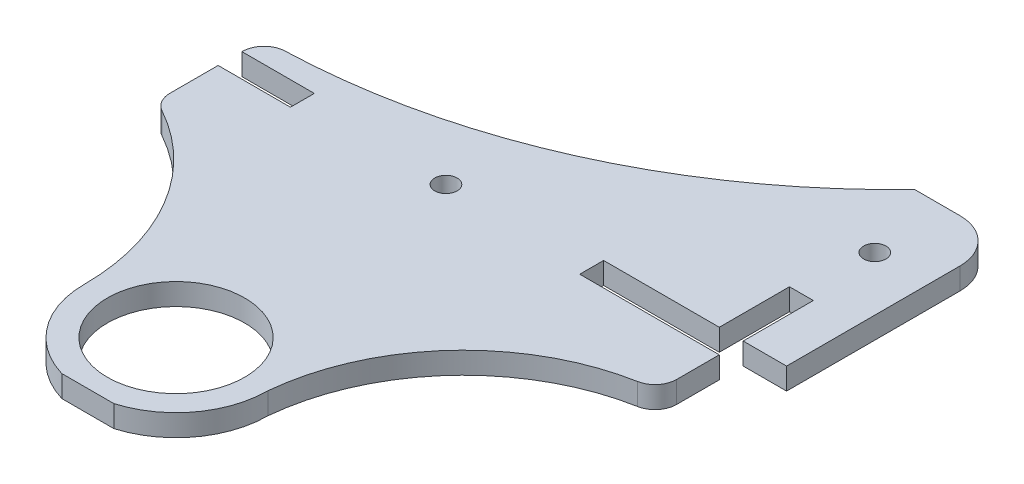
ISO-10303-21;
HEADER;
FILE_DESCRIPTION(('STEP AP214'),'2;1');
FILE_NAME('part.step','',(''),(''),'','','');
FILE_SCHEMA(('AUTOMOTIVE_DESIGN { 1 0 10303 214 1 1 1 1 }'));
ENDSEC;
DATA;
#1=APPLICATION_CONTEXT('core data for automotive mechanical design processes');
#2=APPLICATION_PROTOCOL_DEFINITION('international standard','automotive_design',2000,#1);
#3=PRODUCT_CONTEXT('',#1,'mechanical');
#4=PRODUCT('Part','Part','',(#3));
#5=PRODUCT_RELATED_PRODUCT_CATEGORY('part','',(#4));
#6=PRODUCT_DEFINITION_FORMATION('','',#4);
#7=PRODUCT_DEFINITION_CONTEXT('part definition',#1,'design');
#8=PRODUCT_DEFINITION('design','',#6,#7);
#9=PRODUCT_DEFINITION_SHAPE('','',#8);
#10=(LENGTH_UNIT() NAMED_UNIT(*) SI_UNIT(.MILLI.,.METRE.));
#11=(NAMED_UNIT(*) PLANE_ANGLE_UNIT() SI_UNIT($,.RADIAN.));
#12=(NAMED_UNIT(*) SI_UNIT($,.STERADIAN.) SOLID_ANGLE_UNIT());
#13=UNCERTAINTY_MEASURE_WITH_UNIT(LENGTH_MEASURE(1.E-05),#10,'distance_accuracy_value','');
#14=(GEOMETRIC_REPRESENTATION_CONTEXT(3) GLOBAL_UNCERTAINTY_ASSIGNED_CONTEXT((#13)) GLOBAL_UNIT_ASSIGNED_CONTEXT((#10,
#11,#12)) REPRESENTATION_CONTEXT('',''));
#15=CARTESIAN_POINT('',(0.,0.,0.));
#16=DIRECTION('',(0.,0.,1.));
#17=DIRECTION('',(1.,0.,0.));
#18=AXIS2_PLACEMENT_3D('',#15,#16,#17);
#19=CARTESIAN_POINT('',(0.,3.,0.));
#20=DIRECTION('',(0.,1.,0.));
#21=DIRECTION('',(0.,0.,1.));
#22=AXIS2_PLACEMENT_3D('',#19,#20,#21);
#23=PLANE('',#22);
#24=CARTESIAN_POINT('',(67.8,3.,-61.7));
#25=DIRECTION('',(0.,1.,0.));
#26=DIRECTION('',(0.,0.,1.));
#27=AXIS2_PLACEMENT_3D('',#24,#25,#26);
#28=CIRCLE('',#27,1.54999999999999);
#29=CARTESIAN_POINT('',(67.8,3.,-60.15));
#30=VERTEX_POINT('',#29);
#31=EDGE_CURVE('E454',#30,#30,#28,.T.);
#32=ORIENTED_EDGE('',*,*,#31,.F.);
#33=EDGE_LOOP('',(#32));
#34=FACE_BOUND('',#33,.T.);
#35=CARTESIAN_POINT('',(30.,3.,-40.2));
#36=DIRECTION('',(0.,1.,0.));
#37=DIRECTION('',(0.,0.,1.));
#38=AXIS2_PLACEMENT_3D('',#35,#36,#37);
#39=CIRCLE('',#38,1.55);
#40=CARTESIAN_POINT('',(30.,3.,-38.65));
#41=VERTEX_POINT('',#40);
#42=EDGE_CURVE('E303',#41,#41,#39,.T.);
#43=ORIENTED_EDGE('',*,*,#42,.F.);
#44=EDGE_LOOP('',(#43));
#45=FACE_BOUND('',#44,.T.);
#46=CARTESIAN_POINT('',(29.68,3.,-3.2));
#47=DIRECTION('',(0.,1.,0.));
#48=DIRECTION('',(0.,0.,1.));
#49=AXIS2_PLACEMENT_3D('',#46,#47,#48);
#50=CIRCLE('',#49,9.5);
#51=CARTESIAN_POINT('',(29.68,3.,6.3));
#52=VERTEX_POINT('',#51);
#53=EDGE_CURVE('E448',#52,#52,#50,.T.);
#54=ORIENTED_EDGE('',*,*,#53,.F.);
#55=EDGE_LOOP('',(#54));
#56=FACE_BOUND('',#55,.T.);
#57=CARTESIAN_POINT('',(72.2640108768446,3.,-0.346781756032605));
#58=DIRECTION('',(0.,1.,0.));
#59=DIRECTION('',(0.,0.,1.));
#60=AXIS2_PLACEMENT_3D('',#57,#58,#59);
#61=CIRCLE('',#60,30.);
#62=CARTESIAN_POINT('',(42.4,3.,-3.19999999999998));
#63=VERTEX_POINT('',#62);
#64=CARTESIAN_POINT('',(66.8421828069859,3.,-29.8527774243861));
#65=VERTEX_POINT('',#64);
#66=EDGE_CURVE('E435',#63,#65,#61,.F.);
#67=ORIENTED_EDGE('',*,*,#66,.T.);
#68=CARTESIAN_POINT('',(66.3,3.,-32.8033769912214));
#69=DIRECTION('',(0.,1.,0.));
#70=DIRECTION('',(0.,0.,1.));
#71=AXIS2_PLACEMENT_3D('',#68,#69,#70);
#72=CIRCLE('',#71,3.);
#73=CARTESIAN_POINT('',(69.3,3.,-32.8033769912214));
#74=VERTEX_POINT('',#73);
#75=EDGE_CURVE('E398',#65,#74,#72,.T.);
#76=ORIENTED_EDGE('',*,*,#75,.T.);
#77=DIRECTION('',(0.,0.,-1.));
#78=VECTOR('',#77,1.);
#79=CARTESIAN_POINT('',(69.3,3.,0.));
#80=LINE('',#79,#78);
#81=CARTESIAN_POINT('',(69.3,3.,-38.7));
#82=VERTEX_POINT('',#81);
#83=EDGE_CURVE('E464',#74,#82,#80,.T.);
#84=ORIENTED_EDGE('',*,*,#83,.T.);
#85=DIRECTION('',(-1.,0.,0.));
#86=VECTOR('',#85,1.);
#87=CARTESIAN_POINT('',(69.3,3.,-38.7));
#88=LINE('',#87,#86);
#89=CARTESIAN_POINT('',(50.,3.,-38.7));
#90=VERTEX_POINT('',#89);
#91=EDGE_CURVE('E466',#82,#90,#88,.T.);
#92=ORIENTED_EDGE('',*,*,#91,.T.);
#93=DIRECTION('',(0.,0.,-1.));
#94=VECTOR('',#93,1.);
#95=CARTESIAN_POINT('',(50.,3.,-38.7));
#96=LINE('',#95,#94);
#97=CARTESIAN_POINT('',(50.,3.,-42.));
#98=VERTEX_POINT('',#97);
#99=EDGE_CURVE('E468',#90,#98,#96,.T.);
#100=ORIENTED_EDGE('',*,*,#99,.T.);
#101=DIRECTION('',(1.,0.,0.));
#102=VECTOR('',#101,1.);
#103=CARTESIAN_POINT('',(66.,3.,-42.));
#104=LINE('',#103,#102);
#105=CARTESIAN_POINT('',(66.,3.,-42.));
#106=VERTEX_POINT('',#105);
#107=EDGE_CURVE('E470',#98,#106,#104,.T.);
#108=ORIENTED_EDGE('',*,*,#107,.T.);
#109=DIRECTION('',(0.,0.,-1.));
#110=VECTOR('',#109,1.);
#111=CARTESIAN_POINT('',(66.,3.,-42.));
#112=LINE('',#111,#110);
#113=CARTESIAN_POINT('',(66.,3.,-51.7));
#114=VERTEX_POINT('',#113);
#115=EDGE_CURVE('E472',#106,#114,#112,.T.);
#116=ORIENTED_EDGE('',*,*,#115,.T.);
#117=DIRECTION('',(1.,0.,0.));
#118=VECTOR('',#117,1.);
#119=CARTESIAN_POINT('',(69.3,3.,-51.7));
#120=LINE('',#119,#118);
#121=CARTESIAN_POINT('',(69.3,3.,-51.7));
#122=VERTEX_POINT('',#121);
#123=EDGE_CURVE('E474',#114,#122,#120,.T.);
#124=ORIENTED_EDGE('',*,*,#123,.T.);
#125=DIRECTION('',(0.,0.,1.));
#126=VECTOR('',#125,1.);
#127=CARTESIAN_POINT('',(69.3,3.,-51.7));
#128=LINE('',#127,#126);
#129=CARTESIAN_POINT('',(69.3,3.,-42.));
#130=VERTEX_POINT('',#129);
#131=EDGE_CURVE('E476',#122,#130,#128,.T.);
#132=ORIENTED_EDGE('',*,*,#131,.T.);
#133=DIRECTION('',(1.,0.,0.));
#134=VECTOR('',#133,1.);
#135=CARTESIAN_POINT('',(69.3,3.,-42.));
#136=LINE('',#135,#134);
#137=CARTESIAN_POINT('',(75.3,3.,-42.));
#138=VERTEX_POINT('',#137);
#139=EDGE_CURVE('E478',#130,#138,#136,.T.);
#140=ORIENTED_EDGE('',*,*,#139,.T.);
#141=DIRECTION('',(0.,0.,-1.));
#142=VECTOR('',#141,1.);
#143=CARTESIAN_POINT('',(75.3,3.,-52.));
#144=LINE('',#143,#142);
#145=CARTESIAN_POINT('',(75.3,3.,-66.));
#146=VERTEX_POINT('',#145);
#147=EDGE_CURVE('E480',#138,#146,#144,.T.);
#148=ORIENTED_EDGE('',*,*,#147,.T.);
#149=CARTESIAN_POINT('',(69.3,3.,-66.));
#150=DIRECTION('',(0.,1.,0.));
#151=DIRECTION('',(0.,0.,1.));
#152=AXIS2_PLACEMENT_3D('',#149,#150,#151);
#153=CIRCLE('',#152,6.);
#154=CARTESIAN_POINT('',(69.3,3.,-72.));
#155=VERTEX_POINT('',#154);
#156=EDGE_CURVE('E389',#146,#155,#153,.T.);
#157=ORIENTED_EDGE('',*,*,#156,.T.);
#158=DIRECTION('',(-1.,0.,0.));
#159=VECTOR('',#158,1.);
#160=CARTESIAN_POINT('',(69.3,3.,-72.));
#161=LINE('',#160,#159);
#162=CARTESIAN_POINT('',(63.0000000000033,3.,-72.));
#163=VERTEX_POINT('',#162);
#164=EDGE_CURVE('E425',#155,#163,#161,.T.);
#165=ORIENTED_EDGE('',*,*,#164,.T.);
#166=CARTESIAN_POINT('',(0.,3.,-132.000000000008));
#167=DIRECTION('',(0.,1.,0.));
#168=DIRECTION('',(0.,0.,1.));
#169=AXIS2_PLACEMENT_3D('',#166,#167,#168);
#170=CIRCLE('',#169,87.0000000000078);
#171=CARTESIAN_POINT('',(2.90000000000001,3.,-45.0483467667233));
#172=VERTEX_POINT('',#171);
#173=EDGE_CURVE('E418',#163,#172,#170,.F.);
#174=ORIENTED_EDGE('',*,*,#173,.T.);
#175=CARTESIAN_POINT('',(3.,3.,-42.0500138966103));
#176=DIRECTION('',(0.,1.,0.));
#177=DIRECTION('',(0.,0.,1.));
#178=AXIS2_PLACEMENT_3D('',#175,#176,#177);
#179=CIRCLE('',#178,3.);
#180=CARTESIAN_POINT('',(0.,3.,-42.0500138966103));
#181=VERTEX_POINT('',#180);
#182=EDGE_CURVE('E394',#172,#181,#179,.T.);
#183=ORIENTED_EDGE('',*,*,#182,.T.);
#184=DIRECTION('',(0.,0.,1.));
#185=VECTOR('',#184,1.);
#186=CARTESIAN_POINT('',(0.,3.,-42.));
#187=LINE('',#186,#185);
#188=CARTESIAN_POINT('',(0.,3.,-42.));
#189=VERTEX_POINT('',#188);
#190=EDGE_CURVE('E484',#181,#189,#187,.T.);
#191=ORIENTED_EDGE('',*,*,#190,.T.);
#192=DIRECTION('',(1.,0.,0.));
#193=VECTOR('',#192,1.);
#194=CARTESIAN_POINT('',(0.,3.,-42.));
#195=LINE('',#194,#193);
#196=CARTESIAN_POINT('',(10.,3.,-42.));
#197=VERTEX_POINT('',#196);
#198=EDGE_CURVE('E486',#189,#197,#195,.T.);
#199=ORIENTED_EDGE('',*,*,#198,.T.);
#200=DIRECTION('',(0.,0.,1.));
#201=VECTOR('',#200,1.);
#202=CARTESIAN_POINT('',(10.,3.,-38.7));
#203=LINE('',#202,#201);
#204=CARTESIAN_POINT('',(10.,3.,-38.7));
#205=VERTEX_POINT('',#204);
#206=EDGE_CURVE('E487',#197,#205,#203,.T.);
#207=ORIENTED_EDGE('',*,*,#206,.T.);
#208=DIRECTION('',(-1.,0.,0.));
#209=VECTOR('',#208,1.);
#210=CARTESIAN_POINT('',(0.,3.,-38.7));
#211=LINE('',#210,#209);
#212=CARTESIAN_POINT('',(0.,3.,-38.7));
#213=VERTEX_POINT('',#212);
#214=EDGE_CURVE('E311',#205,#213,#211,.T.);
#215=ORIENTED_EDGE('',*,*,#214,.T.);
#216=DIRECTION('',(0.,0.,1.));
#217=VECTOR('',#216,1.);
#218=CARTESIAN_POINT('',(0.,3.,0.));
#219=LINE('',#218,#217);
#220=CARTESIAN_POINT('',(0.,3.,-32.0217864960837));
#221=VERTEX_POINT('',#220);
#222=EDGE_CURVE('E345',#213,#221,#219,.T.);
#223=ORIENTED_EDGE('',*,*,#222,.T.);
#224=CARTESIAN_POINT('',(3.,3.,-32.0217864960837));
#225=DIRECTION('',(0.,1.,0.));
#226=DIRECTION('',(0.,0.,1.));
#227=AXIS2_PLACEMENT_3D('',#224,#225,#226);
#228=CIRCLE('',#227,3.);
#229=CARTESIAN_POINT('',(1.54181865890877,3.,-29.4000109190189));
#230=VERTEX_POINT('',#229);
#231=EDGE_CURVE('E396',#221,#230,#228,.T.);
#232=ORIENTED_EDGE('',*,*,#231,.T.);
#233=CARTESIAN_POINT('',(-13.0399947520035,3.,-3.1822551483711));
#234=DIRECTION('',(0.,1.,0.));
#235=DIRECTION('',(0.,0.,1.));
#236=AXIS2_PLACEMENT_3D('',#233,#234,#235);
#237=CIRCLE('',#236,30.);
#238=CARTESIAN_POINT('',(16.96,3.,-3.2));
#239=VERTEX_POINT('',#238);
#240=EDGE_CURVE('E285',#239,#230,#237,.T.);
#241=ORIENTED_EDGE('',*,*,#240,.F.);
#242=CARTESIAN_POINT('',(29.68,3.,-3.2));
#243=DIRECTION('',(0.,1.,0.));
#244=DIRECTION('',(0.,0.,1.));
#245=AXIS2_PLACEMENT_3D('',#242,#243,#244);
#246=CIRCLE('',#245,12.72);
#247=CARTESIAN_POINT('',(26.0802222290814,3.,9.));
#248=VERTEX_POINT('',#247);
#249=EDGE_CURVE('E296',#239,#248,#246,.T.);
#250=ORIENTED_EDGE('',*,*,#249,.T.);
#251=DIRECTION('',(1.,0.,0.));
#252=VECTOR('',#251,1.);
#253=CARTESIAN_POINT('',(0.,3.,9.));
#254=LINE('',#253,#252);
#255=CARTESIAN_POINT('',(33.2797777709186,3.,9.));
#256=VERTEX_POINT('',#255);
#257=EDGE_CURVE('E294',#248,#256,#254,.T.);
#258=ORIENTED_EDGE('',*,*,#257,.T.);
#259=EDGE_CURVE('E442',#256,#63,#246,.T.);
#260=ORIENTED_EDGE('',*,*,#259,.T.);
#261=EDGE_LOOP('',(#67,#76,#84,#92,#100,#108,#116,#124,#132,#140,#148,#157,#165,#174,#183,#191,
#199,#207,#215,#223,#232,#241,#250,#258,#260));
#262=FACE_BOUND('',#261,.T.);
#263=ADVANCED_FACE('F110',(#34,#45,#56,#262),#23,.T.);
#264=CARTESIAN_POINT('',(0.,0.,0.));
#265=DIRECTION('',(0.,1.,0.));
#266=DIRECTION('',(0.,0.,1.));
#267=AXIS2_PLACEMENT_3D('',#264,#265,#266);
#268=PLANE('',#267);
#269=CARTESIAN_POINT('',(29.68,0.,-3.2));
#270=DIRECTION('',(0.,1.,0.));
#271=DIRECTION('',(0.,0.,1.));
#272=AXIS2_PLACEMENT_3D('',#269,#270,#271);
#273=CIRCLE('',#272,9.5);
#274=CARTESIAN_POINT('',(29.68,0.,6.3));
#275=VERTEX_POINT('',#274);
#276=EDGE_CURVE('E431',#275,#275,#273,.T.);
#277=ORIENTED_EDGE('',*,*,#276,.T.);
#278=EDGE_LOOP('',(#277));
#279=FACE_BOUND('',#278,.T.);
#280=CARTESIAN_POINT('',(67.8,0.,-61.7));
#281=DIRECTION('',(0.,1.,0.));
#282=DIRECTION('',(0.,0.,1.));
#283=AXIS2_PLACEMENT_3D('',#280,#281,#282);
#284=CIRCLE('',#283,1.54999999999999);
#285=CARTESIAN_POINT('',(67.8,0.,-60.15));
#286=VERTEX_POINT('',#285);
#287=EDGE_CURVE('E451',#286,#286,#284,.T.);
#288=ORIENTED_EDGE('',*,*,#287,.T.);
#289=EDGE_LOOP('',(#288));
#290=FACE_BOUND('',#289,.T.);
#291=CARTESIAN_POINT('',(30.,0.,-40.2));
#292=DIRECTION('',(0.,1.,0.));
#293=DIRECTION('',(0.,0.,1.));
#294=AXIS2_PLACEMENT_3D('',#291,#292,#293);
#295=CIRCLE('',#294,1.55);
#296=CARTESIAN_POINT('',(30.,0.,-38.65));
#297=VERTEX_POINT('',#296);
#298=EDGE_CURVE('E308',#297,#297,#295,.T.);
#299=ORIENTED_EDGE('',*,*,#298,.T.);
#300=EDGE_LOOP('',(#299));
#301=FACE_BOUND('',#300,.T.);
#302=DIRECTION('',(0.,0.,-1.));
#303=VECTOR('',#302,1.);
#304=CARTESIAN_POINT('',(69.3,0.,0.));
#305=LINE('',#304,#303);
#306=CARTESIAN_POINT('',(69.3,0.,-32.8033769912214));
#307=VERTEX_POINT('',#306);
#308=CARTESIAN_POINT('',(69.3,0.,-38.7));
#309=VERTEX_POINT('',#308);
#310=EDGE_CURVE('E302',#307,#309,#305,.T.);
#311=ORIENTED_EDGE('',*,*,#310,.F.);
#312=CARTESIAN_POINT('',(66.3,0.,-32.8033769912214));
#313=DIRECTION('',(0.,1.,0.));
#314=DIRECTION('',(0.,0.,1.));
#315=AXIS2_PLACEMENT_3D('',#312,#313,#314);
#316=CIRCLE('',#315,3.);
#317=CARTESIAN_POINT('',(66.8421828069859,0.,-29.8527774243861));
#318=VERTEX_POINT('',#317);
#319=EDGE_CURVE('E405',#307,#318,#316,.F.);
#320=ORIENTED_EDGE('',*,*,#319,.T.);
#321=CARTESIAN_POINT('',(72.2640108768446,0.,-0.346781756032605));
#322=DIRECTION('',(0.,1.,0.));
#323=DIRECTION('',(0.,0.,1.));
#324=AXIS2_PLACEMENT_3D('',#321,#322,#323);
#325=CIRCLE('',#324,30.);
#326=CARTESIAN_POINT('',(42.4,0.,-3.19999999999998));
#327=VERTEX_POINT('',#326);
#328=EDGE_CURVE('E440',#318,#327,#325,.T.);
#329=ORIENTED_EDGE('',*,*,#328,.T.);
#330=CARTESIAN_POINT('',(29.68,0.,-3.2));
#331=DIRECTION('',(0.,1.,0.));
#332=DIRECTION('',(0.,0.,1.));
#333=AXIS2_PLACEMENT_3D('',#330,#331,#332);
#334=CIRCLE('',#333,12.72);
#335=CARTESIAN_POINT('',(33.2797777709186,0.,9.));
#336=VERTEX_POINT('',#335);
#337=EDGE_CURVE('E295',#327,#336,#334,.F.);
#338=ORIENTED_EDGE('',*,*,#337,.T.);
#339=DIRECTION('',(1.,0.,0.));
#340=VECTOR('',#339,1.);
#341=CARTESIAN_POINT('',(0.,0.,9.));
#342=LINE('',#341,#340);
#343=CARTESIAN_POINT('',(26.0802222290814,0.,9.));
#344=VERTEX_POINT('',#343);
#345=EDGE_CURVE('E292',#344,#336,#342,.T.);
#346=ORIENTED_EDGE('',*,*,#345,.F.);
#347=CARTESIAN_POINT('',(29.68,0.,-3.2));
#348=DIRECTION('',(0.,1.,0.));
#349=DIRECTION('',(0.,0.,1.));
#350=AXIS2_PLACEMENT_3D('',#347,#348,#349);
#351=CIRCLE('',#350,12.72);
#352=CARTESIAN_POINT('',(16.96,0.,-3.2));
#353=VERTEX_POINT('',#352);
#354=EDGE_CURVE('E276',#344,#353,#351,.F.);
#355=ORIENTED_EDGE('',*,*,#354,.T.);
#356=CARTESIAN_POINT('',(-13.0399947520035,0.,-3.1822551483711));
#357=DIRECTION('',(0.,1.,0.));
#358=DIRECTION('',(0.,0.,1.));
#359=AXIS2_PLACEMENT_3D('',#356,#357,#358);
#360=CIRCLE('',#359,30.);
#361=CARTESIAN_POINT('',(1.54181865890877,0.,-29.4000109190189));
#362=VERTEX_POINT('',#361);
#363=EDGE_CURVE('E427',#362,#353,#360,.F.);
#364=ORIENTED_EDGE('',*,*,#363,.F.);
#365=CARTESIAN_POINT('',(3.,0.,-32.0217864960837));
#366=DIRECTION('',(0.,1.,0.));
#367=DIRECTION('',(0.,0.,1.));
#368=AXIS2_PLACEMENT_3D('',#365,#366,#367);
#369=CIRCLE('',#368,3.);
#370=CARTESIAN_POINT('',(0.,0.,-32.0217864960837));
#371=VERTEX_POINT('',#370);
#372=EDGE_CURVE('E403',#362,#371,#369,.F.);
#373=ORIENTED_EDGE('',*,*,#372,.T.);
#374=DIRECTION('',(0.,0.,1.));
#375=VECTOR('',#374,1.);
#376=CARTESIAN_POINT('',(0.,0.,0.));
#377=LINE('',#376,#375);
#378=CARTESIAN_POINT('',(0.,0.,-38.7));
#379=VERTEX_POINT('',#378);
#380=EDGE_CURVE('E342',#379,#371,#377,.T.);
#381=ORIENTED_EDGE('',*,*,#380,.F.);
#382=DIRECTION('',(-1.,0.,0.));
#383=VECTOR('',#382,1.);
#384=CARTESIAN_POINT('',(0.,0.,-38.7));
#385=LINE('',#384,#383);
#386=CARTESIAN_POINT('',(10.,0.,-38.7));
#387=VERTEX_POINT('',#386);
#388=EDGE_CURVE('E340',#387,#379,#385,.T.);
#389=ORIENTED_EDGE('',*,*,#388,.F.);
#390=DIRECTION('',(0.,0.,1.));
#391=VECTOR('',#390,1.);
#392=CARTESIAN_POINT('',(10.,0.,-38.7));
#393=LINE('',#392,#391);
#394=CARTESIAN_POINT('',(10.,0.,-42.));
#395=VERTEX_POINT('',#394);
#396=EDGE_CURVE('E338',#395,#387,#393,.T.);
#397=ORIENTED_EDGE('',*,*,#396,.F.);
#398=DIRECTION('',(1.,0.,0.));
#399=VECTOR('',#398,1.);
#400=CARTESIAN_POINT('',(0.,0.,-42.));
#401=LINE('',#400,#399);
#402=CARTESIAN_POINT('',(0.,0.,-42.));
#403=VERTEX_POINT('',#402);
#404=EDGE_CURVE('E336',#403,#395,#401,.T.);
#405=ORIENTED_EDGE('',*,*,#404,.F.);
#406=DIRECTION('',(0.,0.,1.));
#407=VECTOR('',#406,1.);
#408=CARTESIAN_POINT('',(0.,0.,-42.));
#409=LINE('',#408,#407);
#410=CARTESIAN_POINT('',(0.,0.,-42.0500138966103));
#411=VERTEX_POINT('',#410);
#412=EDGE_CURVE('E334',#411,#403,#409,.T.);
#413=ORIENTED_EDGE('',*,*,#412,.F.);
#414=CARTESIAN_POINT('',(3.,0.,-42.0500138966103));
#415=DIRECTION('',(0.,1.,0.));
#416=DIRECTION('',(0.,0.,1.));
#417=AXIS2_PLACEMENT_3D('',#414,#415,#416);
#418=CIRCLE('',#417,3.);
#419=CARTESIAN_POINT('',(2.90000000000001,0.,-45.0483467667233));
#420=VERTEX_POINT('',#419);
#421=EDGE_CURVE('E125',#411,#420,#418,.F.);
#422=ORIENTED_EDGE('',*,*,#421,.T.);
#423=CARTESIAN_POINT('',(0.,0.,-132.000000000008));
#424=DIRECTION('',(0.,1.,0.));
#425=DIRECTION('',(0.,0.,1.));
#426=AXIS2_PLACEMENT_3D('',#423,#424,#425);
#427=CIRCLE('',#426,87.0000000000078);
#428=CARTESIAN_POINT('',(63.0000000000033,0.,-72.));
#429=VERTEX_POINT('',#428);
#430=EDGE_CURVE('E420',#420,#429,#427,.T.);
#431=ORIENTED_EDGE('',*,*,#430,.T.);
#432=DIRECTION('',(-1.,0.,0.));
#433=VECTOR('',#432,1.);
#434=CARTESIAN_POINT('',(0.,0.,-72.));
#435=LINE('',#434,#433);
#436=CARTESIAN_POINT('',(69.3,0.,-72.));
#437=VERTEX_POINT('',#436);
#438=EDGE_CURVE('E331',#437,#429,#435,.T.);
#439=ORIENTED_EDGE('',*,*,#438,.F.);
#440=CARTESIAN_POINT('',(69.3,0.,-66.));
#441=DIRECTION('',(0.,1.,0.));
#442=DIRECTION('',(0.,0.,1.));
#443=AXIS2_PLACEMENT_3D('',#440,#441,#442);
#444=CIRCLE('',#443,6.);
#445=CARTESIAN_POINT('',(75.3,0.,-66.));
#446=VERTEX_POINT('',#445);
#447=EDGE_CURVE('E385',#437,#446,#444,.F.);
#448=ORIENTED_EDGE('',*,*,#447,.T.);
#449=DIRECTION('',(0.,0.,-1.));
#450=VECTOR('',#449,1.);
#451=CARTESIAN_POINT('',(75.3,0.,-72.));
#452=LINE('',#451,#450);
#453=CARTESIAN_POINT('',(75.3,0.,-42.));
#454=VERTEX_POINT('',#453);
#455=EDGE_CURVE('E328',#454,#446,#452,.T.);
#456=ORIENTED_EDGE('',*,*,#455,.F.);
#457=DIRECTION('',(1.,0.,0.));
#458=VECTOR('',#457,1.);
#459=CARTESIAN_POINT('',(69.3,0.,-42.));
#460=LINE('',#459,#458);
#461=CARTESIAN_POINT('',(69.3,0.,-42.));
#462=VERTEX_POINT('',#461);
#463=EDGE_CURVE('E325',#462,#454,#460,.T.);
#464=ORIENTED_EDGE('',*,*,#463,.F.);
#465=DIRECTION('',(0.,0.,1.));
#466=VECTOR('',#465,1.);
#467=CARTESIAN_POINT('',(69.3,0.,-51.7));
#468=LINE('',#467,#466);
#469=CARTESIAN_POINT('',(69.3,0.,-51.7));
#470=VERTEX_POINT('',#469);
#471=EDGE_CURVE('E323',#470,#462,#468,.T.);
#472=ORIENTED_EDGE('',*,*,#471,.F.);
#473=DIRECTION('',(1.,0.,0.));
#474=VECTOR('',#473,1.);
#475=CARTESIAN_POINT('',(69.3,0.,-51.7));
#476=LINE('',#475,#474);
#477=CARTESIAN_POINT('',(66.,0.,-51.7));
#478=VERTEX_POINT('',#477);
#479=EDGE_CURVE('E321',#478,#470,#476,.T.);
#480=ORIENTED_EDGE('',*,*,#479,.F.);
#481=DIRECTION('',(0.,0.,-1.));
#482=VECTOR('',#481,1.);
#483=CARTESIAN_POINT('',(66.,0.,-42.));
#484=LINE('',#483,#482);
#485=CARTESIAN_POINT('',(66.,0.,-42.));
#486=VERTEX_POINT('',#485);
#487=EDGE_CURVE('E319',#486,#478,#484,.T.);
#488=ORIENTED_EDGE('',*,*,#487,.F.);
#489=DIRECTION('',(1.,0.,0.));
#490=VECTOR('',#489,1.);
#491=CARTESIAN_POINT('',(66.,0.,-42.));
#492=LINE('',#491,#490);
#493=CARTESIAN_POINT('',(50.,0.,-42.));
#494=VERTEX_POINT('',#493);
#495=EDGE_CURVE('E317',#494,#486,#492,.T.);
#496=ORIENTED_EDGE('',*,*,#495,.F.);
#497=DIRECTION('',(0.,0.,-1.));
#498=VECTOR('',#497,1.);
#499=CARTESIAN_POINT('',(50.,0.,-38.7));
#500=LINE('',#499,#498);
#501=CARTESIAN_POINT('',(50.,0.,-38.7));
#502=VERTEX_POINT('',#501);
#503=EDGE_CURVE('E315',#502,#494,#500,.T.);
#504=ORIENTED_EDGE('',*,*,#503,.F.);
#505=DIRECTION('',(-1.,0.,0.));
#506=VECTOR('',#505,1.);
#507=CARTESIAN_POINT('',(69.3,0.,-38.7));
#508=LINE('',#507,#506);
#509=EDGE_CURVE('E305',#309,#502,#508,.T.);
#510=ORIENTED_EDGE('',*,*,#509,.F.);
#511=EDGE_LOOP('',(#311,#320,#329,#338,#346,#355,#364,#373,#381,#389,#397,#405,#413,#422,#431,
#439,#448,#456,#464,#472,#480,#488,#496,#504,#510));
#512=FACE_BOUND('',#511,.T.);
#513=ADVANCED_FACE('F300',(#279,#290,#301,#512),#268,.F.);
#514=CARTESIAN_POINT('',(0.,3.,9.));
#515=DIRECTION('',(0.,0.,-1.));
#516=DIRECTION('',(-1.,0.,0.));
#517=AXIS2_PLACEMENT_3D('',#514,#515,#516);
#518=PLANE('',#517);
#519=DIRECTION('',(0.,1.,0.));
#520=VECTOR('',#519,1.);
#521=CARTESIAN_POINT('',(26.0802222290814,-112.085431560217,9.));
#522=LINE('',#521,#520);
#523=EDGE_CURVE('E280',#344,#248,#522,.T.);
#524=ORIENTED_EDGE('',*,*,#523,.F.);
#525=ORIENTED_EDGE('',*,*,#345,.T.);
#526=DIRECTION('',(0.,1.,0.));
#527=VECTOR('',#526,1.);
#528=CARTESIAN_POINT('',(33.2797777709186,-112.085431560217,9.));
#529=LINE('',#528,#527);
#530=EDGE_CURVE('E441',#336,#256,#529,.T.);
#531=ORIENTED_EDGE('',*,*,#530,.T.);
#532=ORIENTED_EDGE('',*,*,#257,.F.);
#533=EDGE_LOOP('',(#524,#525,#531,#532));
#534=FACE_BOUND('',#533,.T.);
#535=ADVANCED_FACE('F290',(#534),#518,.F.);
#536=CARTESIAN_POINT('',(69.3,3.,0.));
#537=DIRECTION('',(-1.,0.,0.));
#538=DIRECTION('',(0.,0.,1.));
#539=AXIS2_PLACEMENT_3D('',#536,#537,#538);
#540=PLANE('',#539);
#541=ORIENTED_EDGE('',*,*,#83,.F.);
#542=DIRECTION('',(0.,-1.,0.));
#543=VECTOR('',#542,1.);
#544=CARTESIAN_POINT('',(69.3,0.,-32.8033769912214));
#545=LINE('',#544,#543);
#546=EDGE_CURVE('E400',#74,#307,#545,.T.);
#547=ORIENTED_EDGE('',*,*,#546,.T.);
#548=ORIENTED_EDGE('',*,*,#310,.T.);
#549=DIRECTION('',(0.,-1.,0.));
#550=VECTOR('',#549,1.);
#551=CARTESIAN_POINT('',(69.3,3.,-38.7));
#552=LINE('',#551,#550);
#553=EDGE_CURVE('E379',#82,#309,#552,.T.);
#554=ORIENTED_EDGE('',*,*,#553,.F.);
#555=EDGE_LOOP('',(#541,#547,#548,#554));
#556=FACE_BOUND('',#555,.T.);
#557=ADVANCED_FACE('F526',(#556),#540,.F.);
#558=CARTESIAN_POINT('',(0.,3.,-72.));
#559=DIRECTION('',(0.,0.,1.));
#560=DIRECTION('',(1.,0.,0.));
#561=AXIS2_PLACEMENT_3D('',#558,#559,#560);
#562=PLANE('',#561);
#563=ORIENTED_EDGE('',*,*,#164,.F.);
#564=DIRECTION('',(0.,-1.,0.));
#565=VECTOR('',#564,1.);
#566=CARTESIAN_POINT('',(69.3,3.,-72.));
#567=LINE('',#566,#565);
#568=EDGE_CURVE('E382',#155,#437,#567,.T.);
#569=ORIENTED_EDGE('',*,*,#568,.T.);
#570=ORIENTED_EDGE('',*,*,#438,.T.);
#571=DIRECTION('',(0.,1.,0.));
#572=VECTOR('',#571,1.);
#573=CARTESIAN_POINT('',(63.0000000000033,-112.085431560217,-72.));
#574=LINE('',#573,#572);
#575=EDGE_CURVE('E428',#429,#163,#574,.T.);
#576=ORIENTED_EDGE('',*,*,#575,.T.);
#577=EDGE_LOOP('',(#563,#569,#570,#576));
#578=FACE_BOUND('',#577,.T.);
#579=ADVANCED_FACE('F571',(#578),#562,.F.);
#580=CARTESIAN_POINT('',(0.,3.,-42.));
#581=DIRECTION('',(1.,0.,0.));
#582=DIRECTION('',(0.,0.,-1.));
#583=AXIS2_PLACEMENT_3D('',#580,#581,#582);
#584=PLANE('',#583);
#585=ORIENTED_EDGE('',*,*,#190,.F.);
#586=DIRECTION('',(0.,-1.,0.));
#587=VECTOR('',#586,1.);
#588=CARTESIAN_POINT('',(0.,0.,-42.0500138966103));
#589=LINE('',#588,#587);
#590=EDGE_CURVE('E13',#181,#411,#589,.T.);
#591=ORIENTED_EDGE('',*,*,#590,.T.);
#592=ORIENTED_EDGE('',*,*,#412,.T.);
#593=DIRECTION('',(0.,-1.,0.));
#594=VECTOR('',#593,1.);
#595=CARTESIAN_POINT('',(0.,3.,-42.));
#596=LINE('',#595,#594);
#597=EDGE_CURVE('E355',#189,#403,#596,.T.);
#598=ORIENTED_EDGE('',*,*,#597,.F.);
#599=EDGE_LOOP('',(#585,#591,#592,#598));
#600=FACE_BOUND('',#599,.T.);
#601=ADVANCED_FACE('F606',(#600),#584,.F.);
#602=CARTESIAN_POINT('',(69.3,3.,-38.7));
#603=DIRECTION('',(0.,0.,1.));
#604=DIRECTION('',(1.,0.,0.));
#605=AXIS2_PLACEMENT_3D('',#602,#603,#604);
#606=PLANE('',#605);
#607=ORIENTED_EDGE('',*,*,#509,.T.);
#608=DIRECTION('',(0.,-1.,0.));
#609=VECTOR('',#608,1.);
#610=CARTESIAN_POINT('',(50.,3.,-38.7));
#611=LINE('',#610,#609);
#612=EDGE_CURVE('E376',#90,#502,#611,.T.);
#613=ORIENTED_EDGE('',*,*,#612,.F.);
#614=ORIENTED_EDGE('',*,*,#91,.F.);
#615=ORIENTED_EDGE('',*,*,#553,.T.);
#616=EDGE_LOOP('',(#607,#613,#614,#615));
#617=FACE_BOUND('',#616,.T.);
#618=ADVANCED_FACE('F531',(#617),#606,.F.);
#619=CARTESIAN_POINT('',(50.,3.,-38.7));
#620=DIRECTION('',(-1.,0.,0.));
#621=DIRECTION('',(0.,0.,1.));
#622=AXIS2_PLACEMENT_3D('',#619,#620,#621);
#623=PLANE('',#622);
#624=ORIENTED_EDGE('',*,*,#503,.T.);
#625=DIRECTION('',(0.,-1.,0.));
#626=VECTOR('',#625,1.);
#627=CARTESIAN_POINT('',(50.,3.,-42.));
#628=LINE('',#627,#626);
#629=EDGE_CURVE('E373',#98,#494,#628,.T.);
#630=ORIENTED_EDGE('',*,*,#629,.F.);
#631=ORIENTED_EDGE('',*,*,#99,.F.);
#632=ORIENTED_EDGE('',*,*,#612,.T.);
#633=EDGE_LOOP('',(#624,#630,#631,#632));
#634=FACE_BOUND('',#633,.T.);
#635=ADVANCED_FACE('F537',(#634),#623,.F.);
#636=CARTESIAN_POINT('',(66.,3.,-42.));
#637=DIRECTION('',(0.,0.,-1.));
#638=DIRECTION('',(-1.,0.,0.));
#639=AXIS2_PLACEMENT_3D('',#636,#637,#638);
#640=PLANE('',#639);
#641=ORIENTED_EDGE('',*,*,#495,.T.);
#642=DIRECTION('',(0.,-1.,0.));
#643=VECTOR('',#642,1.);
#644=CARTESIAN_POINT('',(66.,3.,-42.));
#645=LINE('',#644,#643);
#646=EDGE_CURVE('E370',#106,#486,#645,.T.);
#647=ORIENTED_EDGE('',*,*,#646,.F.);
#648=ORIENTED_EDGE('',*,*,#107,.F.);
#649=ORIENTED_EDGE('',*,*,#629,.T.);
#650=EDGE_LOOP('',(#641,#647,#648,#649));
#651=FACE_BOUND('',#650,.T.);
#652=ADVANCED_FACE('F541',(#651),#640,.F.);
#653=CARTESIAN_POINT('',(66.,3.,-42.));
#654=DIRECTION('',(-1.,0.,0.));
#655=DIRECTION('',(0.,0.,1.));
#656=AXIS2_PLACEMENT_3D('',#653,#654,#655);
#657=PLANE('',#656);
#658=ORIENTED_EDGE('',*,*,#487,.T.);
#659=DIRECTION('',(0.,-1.,0.));
#660=VECTOR('',#659,1.);
#661=CARTESIAN_POINT('',(66.,3.,-51.7));
#662=LINE('',#661,#660);
#663=EDGE_CURVE('E367',#114,#478,#662,.T.);
#664=ORIENTED_EDGE('',*,*,#663,.F.);
#665=ORIENTED_EDGE('',*,*,#115,.F.);
#666=ORIENTED_EDGE('',*,*,#646,.T.);
#667=EDGE_LOOP('',(#658,#664,#665,#666));
#668=FACE_BOUND('',#667,.T.);
#669=ADVANCED_FACE('F546',(#668),#657,.F.);
#670=CARTESIAN_POINT('',(69.3,3.,-51.7));
#671=DIRECTION('',(0.,0.,-1.));
#672=DIRECTION('',(-1.,0.,0.));
#673=AXIS2_PLACEMENT_3D('',#670,#671,#672);
#674=PLANE('',#673);
#675=ORIENTED_EDGE('',*,*,#479,.T.);
#676=DIRECTION('',(0.,-1.,0.));
#677=VECTOR('',#676,1.);
#678=CARTESIAN_POINT('',(69.3,3.,-51.7));
#679=LINE('',#678,#677);
#680=EDGE_CURVE('E364',#122,#470,#679,.T.);
#681=ORIENTED_EDGE('',*,*,#680,.F.);
#682=ORIENTED_EDGE('',*,*,#123,.F.);
#683=ORIENTED_EDGE('',*,*,#663,.T.);
#684=EDGE_LOOP('',(#675,#681,#682,#683));
#685=FACE_BOUND('',#684,.T.);
#686=ADVANCED_FACE('F552',(#685),#674,.F.);
#687=CARTESIAN_POINT('',(69.3,3.,-51.7));
#688=DIRECTION('',(1.,0.,0.));
#689=DIRECTION('',(0.,0.,-1.));
#690=AXIS2_PLACEMENT_3D('',#687,#688,#689);
#691=PLANE('',#690);
#692=ORIENTED_EDGE('',*,*,#471,.T.);
#693=DIRECTION('',(0.,-1.,0.));
#694=VECTOR('',#693,1.);
#695=CARTESIAN_POINT('',(69.3,3.,-42.));
#696=LINE('',#695,#694);
#697=EDGE_CURVE('E361',#130,#462,#696,.T.);
#698=ORIENTED_EDGE('',*,*,#697,.F.);
#699=ORIENTED_EDGE('',*,*,#131,.F.);
#700=ORIENTED_EDGE('',*,*,#680,.T.);
#701=EDGE_LOOP('',(#692,#698,#699,#700));
#702=FACE_BOUND('',#701,.T.);
#703=ADVANCED_FACE('F556',(#702),#691,.F.);
#704=CARTESIAN_POINT('',(69.3,3.,-42.));
#705=DIRECTION('',(0.,0.,-1.));
#706=DIRECTION('',(-1.,0.,0.));
#707=AXIS2_PLACEMENT_3D('',#704,#705,#706);
#708=PLANE('',#707);
#709=ORIENTED_EDGE('',*,*,#463,.T.);
#710=DIRECTION('',(0.,-1.,0.));
#711=VECTOR('',#710,1.);
#712=CARTESIAN_POINT('',(75.3,3.,-42.));
#713=LINE('',#712,#711);
#714=EDGE_CURVE('E358',#138,#454,#713,.T.);
#715=ORIENTED_EDGE('',*,*,#714,.F.);
#716=ORIENTED_EDGE('',*,*,#139,.F.);
#717=ORIENTED_EDGE('',*,*,#697,.T.);
#718=EDGE_LOOP('',(#709,#715,#716,#717));
#719=FACE_BOUND('',#718,.T.);
#720=ADVANCED_FACE('F561',(#719),#708,.F.);
#721=CARTESIAN_POINT('',(75.3,3.,-72.));
#722=DIRECTION('',(-1.,0.,0.));
#723=DIRECTION('',(0.,0.,1.));
#724=AXIS2_PLACEMENT_3D('',#721,#722,#723);
#725=PLANE('',#724);
#726=ORIENTED_EDGE('',*,*,#455,.T.);
#727=DIRECTION('',(0.,-1.,0.));
#728=VECTOR('',#727,1.);
#729=CARTESIAN_POINT('',(75.3,3.,-66.));
#730=LINE('',#729,#728);
#731=EDGE_CURVE('E387',#446,#146,#730,.F.);
#732=ORIENTED_EDGE('',*,*,#731,.T.);
#733=ORIENTED_EDGE('',*,*,#147,.F.);
#734=ORIENTED_EDGE('',*,*,#714,.T.);
#735=EDGE_LOOP('',(#726,#732,#733,#734));
#736=FACE_BOUND('',#735,.T.);
#737=ADVANCED_FACE('F572',(#736),#725,.F.);
#738=CARTESIAN_POINT('',(0.,3.,-42.));
#739=DIRECTION('',(0.,0.,-1.));
#740=DIRECTION('',(-1.,0.,0.));
#741=AXIS2_PLACEMENT_3D('',#738,#739,#740);
#742=PLANE('',#741);
#743=ORIENTED_EDGE('',*,*,#404,.T.);
#744=DIRECTION('',(0.,-1.,0.));
#745=VECTOR('',#744,1.);
#746=CARTESIAN_POINT('',(10.,3.,-42.));
#747=LINE('',#746,#745);
#748=EDGE_CURVE('E352',#197,#395,#747,.T.);
#749=ORIENTED_EDGE('',*,*,#748,.F.);
#750=ORIENTED_EDGE('',*,*,#198,.F.);
#751=ORIENTED_EDGE('',*,*,#597,.T.);
#752=EDGE_LOOP('',(#743,#749,#750,#751));
#753=FACE_BOUND('',#752,.T.);
#754=ADVANCED_FACE('F574',(#753),#742,.F.);
#755=CARTESIAN_POINT('',(10.,3.,-38.7));
#756=DIRECTION('',(1.,0.,0.));
#757=DIRECTION('',(0.,0.,-1.));
#758=AXIS2_PLACEMENT_3D('',#755,#756,#757);
#759=PLANE('',#758);
#760=ORIENTED_EDGE('',*,*,#396,.T.);
#761=DIRECTION('',(0.,-1.,0.));
#762=VECTOR('',#761,1.);
#763=CARTESIAN_POINT('',(10.,3.,-38.7));
#764=LINE('',#763,#762);
#765=EDGE_CURVE('E349',#205,#387,#764,.T.);
#766=ORIENTED_EDGE('',*,*,#765,.F.);
#767=ORIENTED_EDGE('',*,*,#206,.F.);
#768=ORIENTED_EDGE('',*,*,#748,.T.);
#769=EDGE_LOOP('',(#760,#766,#767,#768));
#770=FACE_BOUND('',#769,.T.);
#771=ADVANCED_FACE('F580',(#770),#759,.F.);
#772=CARTESIAN_POINT('',(0.,3.,-38.7));
#773=DIRECTION('',(0.,0.,1.));
#774=DIRECTION('',(1.,0.,0.));
#775=AXIS2_PLACEMENT_3D('',#772,#773,#774);
#776=PLANE('',#775);
#777=ORIENTED_EDGE('',*,*,#388,.T.);
#778=DIRECTION('',(0.,-1.,0.));
#779=VECTOR('',#778,1.);
#780=CARTESIAN_POINT('',(0.,3.,-38.7));
#781=LINE('',#780,#779);
#782=EDGE_CURVE('E346',#213,#379,#781,.T.);
#783=ORIENTED_EDGE('',*,*,#782,.F.);
#784=ORIENTED_EDGE('',*,*,#214,.F.);
#785=ORIENTED_EDGE('',*,*,#765,.T.);
#786=EDGE_LOOP('',(#777,#783,#784,#785));
#787=FACE_BOUND('',#786,.T.);
#788=ADVANCED_FACE('F494',(#787),#776,.F.);
#789=CARTESIAN_POINT('',(0.,3.,0.));
#790=DIRECTION('',(1.,0.,0.));
#791=DIRECTION('',(0.,0.,-1.));
#792=AXIS2_PLACEMENT_3D('',#789,#790,#791);
#793=PLANE('',#792);
#794=ORIENTED_EDGE('',*,*,#380,.T.);
#795=DIRECTION('',(0.,1.,0.));
#796=VECTOR('',#795,1.);
#797=CARTESIAN_POINT('',(0.,3.,-32.0217864960837));
#798=LINE('',#797,#796);
#799=EDGE_CURVE('E407',#371,#221,#798,.T.);
#800=ORIENTED_EDGE('',*,*,#799,.T.);
#801=ORIENTED_EDGE('',*,*,#222,.F.);
#802=ORIENTED_EDGE('',*,*,#782,.T.);
#803=EDGE_LOOP('',(#794,#800,#801,#802));
#804=FACE_BOUND('',#803,.T.);
#805=ADVANCED_FACE('F498',(#804),#793,.F.);
#806=CARTESIAN_POINT('',(30.,3.,-40.2));
#807=DIRECTION('',(0.,-1.,0.));
#808=DIRECTION('',(0.,0.,-1.));
#809=AXIS2_PLACEMENT_3D('',#806,#807,#808);
#810=CYLINDRICAL_SURFACE('',#809,1.55);
#811=ORIENTED_EDGE('',*,*,#42,.T.);
#812=EDGE_LOOP('',(#811));
#813=FACE_BOUND('',#812,.T.);
#814=ORIENTED_EDGE('',*,*,#298,.F.);
#815=EDGE_LOOP('',(#814));
#816=FACE_BOUND('',#815,.T.);
#817=ADVANCED_FACE('F596',(#813,#816),#810,.F.);
#818=CARTESIAN_POINT('',(67.8,3.,-61.7));
#819=DIRECTION('',(0.,-1.,0.));
#820=DIRECTION('',(0.,0.,-1.));
#821=AXIS2_PLACEMENT_3D('',#818,#819,#820);
#822=CYLINDRICAL_SURFACE('',#821,1.54999999999999);
#823=ORIENTED_EDGE('',*,*,#31,.T.);
#824=EDGE_LOOP('',(#823));
#825=FACE_BOUND('',#824,.T.);
#826=ORIENTED_EDGE('',*,*,#287,.F.);
#827=EDGE_LOOP('',(#826));
#828=FACE_BOUND('',#827,.T.);
#829=ADVANCED_FACE('F742',(#825,#828),#822,.F.);
#830=CARTESIAN_POINT('',(29.68,3.,-3.2));
#831=DIRECTION('',(0.,-1.,0.));
#832=DIRECTION('',(0.,0.,-1.));
#833=AXIS2_PLACEMENT_3D('',#830,#831,#832);
#834=CYLINDRICAL_SURFACE('',#833,9.5);
#835=ORIENTED_EDGE('',*,*,#53,.T.);
#836=EDGE_LOOP('',(#835));
#837=FACE_BOUND('',#836,.T.);
#838=ORIENTED_EDGE('',*,*,#276,.F.);
#839=EDGE_LOOP('',(#838));
#840=FACE_BOUND('',#839,.T.);
#841=ADVANCED_FACE('F669',(#837,#840),#834,.F.);
#842=CARTESIAN_POINT('',(-13.0399947520035,-112.085431560217,-3.1822551483711));
#843=DIRECTION('',(0.,1.,0.));
#844=DIRECTION('',(0.,0.,1.));
#845=AXIS2_PLACEMENT_3D('',#842,#843,#844);
#846=CYLINDRICAL_SURFACE('',#845,30.);
#847=ORIENTED_EDGE('',*,*,#240,.T.);
#848=DIRECTION('',(0.,1.,0.));
#849=VECTOR('',#848,1.);
#850=CARTESIAN_POINT('',(1.54181865890877,-112.085431560217,-29.4000109190189));
#851=LINE('',#850,#849);
#852=EDGE_CURVE('E410',#230,#362,#851,.F.);
#853=ORIENTED_EDGE('',*,*,#852,.T.);
#854=ORIENTED_EDGE('',*,*,#363,.T.);
#855=DIRECTION('',(0.,1.,0.));
#856=VECTOR('',#855,1.);
#857=CARTESIAN_POINT('',(16.96,-112.085431560217,-3.2));
#858=LINE('',#857,#856);
#859=EDGE_CURVE('E282',#353,#239,#858,.T.);
#860=ORIENTED_EDGE('',*,*,#859,.T.);
#861=EDGE_LOOP('',(#847,#853,#854,#860));
#862=FACE_BOUND('',#861,.T.);
#863=ADVANCED_FACE('F508',(#862),#846,.F.);
#864=CARTESIAN_POINT('',(29.68,-112.085431560217,-3.2));
#865=DIRECTION('',(0.,1.,0.));
#866=DIRECTION('',(0.,0.,1.));
#867=AXIS2_PLACEMENT_3D('',#864,#865,#866);
#868=CYLINDRICAL_SURFACE('',#867,12.72);
#869=ORIENTED_EDGE('',*,*,#523,.T.);
#870=ORIENTED_EDGE('',*,*,#249,.F.);
#871=ORIENTED_EDGE('',*,*,#859,.F.);
#872=ORIENTED_EDGE('',*,*,#354,.F.);
#873=EDGE_LOOP('',(#869,#870,#871,#872));
#874=FACE_BOUND('',#873,.T.);
#875=ADVANCED_FACE('F278',(#874),#868,.T.);
#876=CARTESIAN_POINT('',(0.,-112.085431560217,-132.000000000008));
#877=DIRECTION('',(0.,1.,0.));
#878=DIRECTION('',(0.,0.,1.));
#879=AXIS2_PLACEMENT_3D('',#876,#877,#878);
#880=CYLINDRICAL_SURFACE('',#879,87.0000000000078);
#881=ORIENTED_EDGE('',*,*,#430,.F.);
#882=DIRECTION('',(0.,1.,0.));
#883=VECTOR('',#882,1.);
#884=CARTESIAN_POINT('',(2.90000000000001,-112.085431560217,-45.0483467667233));
#885=LINE('',#884,#883);
#886=EDGE_CURVE('E118',#420,#172,#885,.T.);
#887=ORIENTED_EDGE('',*,*,#886,.T.);
#888=ORIENTED_EDGE('',*,*,#173,.F.);
#889=ORIENTED_EDGE('',*,*,#575,.F.);
#890=EDGE_LOOP('',(#881,#887,#888,#889));
#891=FACE_BOUND('',#890,.T.);
#892=ADVANCED_FACE('F416',(#891),#880,.F.);
#893=DIRECTION('',(0.,1.,0.));
#894=VECTOR('',#893,1.);
#895=CARTESIAN_POINT('',(42.4,-112.085431560217,-3.19999999999998));
#896=LINE('',#895,#894);
#897=EDGE_CURVE('E438',#327,#63,#896,.T.);
#898=ORIENTED_EDGE('',*,*,#897,.T.);
#899=ORIENTED_EDGE('',*,*,#259,.F.);
#900=ORIENTED_EDGE('',*,*,#530,.F.);
#901=ORIENTED_EDGE('',*,*,#337,.F.);
#902=EDGE_LOOP('',(#898,#899,#900,#901));
#903=FACE_BOUND('',#902,.T.);
#904=ADVANCED_FACE('F513',(#903),#868,.T.);
#905=CARTESIAN_POINT('',(72.2640108768446,-112.085431560217,-0.346781756032605));
#906=DIRECTION('',(0.,1.,0.));
#907=DIRECTION('',(0.,0.,1.));
#908=AXIS2_PLACEMENT_3D('',#905,#906,#907);
#909=CYLINDRICAL_SURFACE('',#908,30.);
#910=ORIENTED_EDGE('',*,*,#328,.F.);
#911=DIRECTION('',(0.,1.,0.));
#912=VECTOR('',#911,1.);
#913=CARTESIAN_POINT('',(66.8421828069859,-112.085431560217,-29.8527774243861));
#914=LINE('',#913,#912);
#915=EDGE_CURVE('E391',#318,#65,#914,.T.);
#916=ORIENTED_EDGE('',*,*,#915,.T.);
#917=ORIENTED_EDGE('',*,*,#66,.F.);
#918=ORIENTED_EDGE('',*,*,#897,.F.);
#919=EDGE_LOOP('',(#910,#916,#917,#918));
#920=FACE_BOUND('',#919,.T.);
#921=ADVANCED_FACE('F517',(#920),#909,.F.);
#922=CARTESIAN_POINT('',(69.3,3.,-66.));
#923=DIRECTION('',(0.,-1.,0.));
#924=DIRECTION('',(0.,0.,-1.));
#925=AXIS2_PLACEMENT_3D('',#922,#923,#924);
#926=CYLINDRICAL_SURFACE('',#925,6.);
#927=ORIENTED_EDGE('',*,*,#156,.F.);
#928=ORIENTED_EDGE('',*,*,#731,.F.);
#929=ORIENTED_EDGE('',*,*,#447,.F.);
#930=ORIENTED_EDGE('',*,*,#568,.F.);
#931=EDGE_LOOP('',(#927,#928,#929,#930));
#932=FACE_BOUND('',#931,.T.);
#933=ADVANCED_FACE('F568',(#932),#926,.T.);
#934=CARTESIAN_POINT('',(66.3,-112.085431560217,-32.8033769912214));
#935=DIRECTION('',(0.,1.,0.));
#936=DIRECTION('',(0.,0.,1.));
#937=AXIS2_PLACEMENT_3D('',#934,#935,#936);
#938=CYLINDRICAL_SURFACE('',#937,3.);
#939=ORIENTED_EDGE('',*,*,#319,.F.);
#940=ORIENTED_EDGE('',*,*,#546,.F.);
#941=ORIENTED_EDGE('',*,*,#75,.F.);
#942=ORIENTED_EDGE('',*,*,#915,.F.);
#943=EDGE_LOOP('',(#939,#940,#941,#942));
#944=FACE_BOUND('',#943,.T.);
#945=ADVANCED_FACE('F521',(#944),#938,.T.);
#946=CARTESIAN_POINT('',(3.,-112.085431560217,-32.0217864960837));
#947=DIRECTION('',(0.,1.,0.));
#948=DIRECTION('',(0.,0.,1.));
#949=AXIS2_PLACEMENT_3D('',#946,#947,#948);
#950=CYLINDRICAL_SURFACE('',#949,3.);
#951=ORIENTED_EDGE('',*,*,#372,.F.);
#952=ORIENTED_EDGE('',*,*,#852,.F.);
#953=ORIENTED_EDGE('',*,*,#231,.F.);
#954=ORIENTED_EDGE('',*,*,#799,.F.);
#955=EDGE_LOOP('',(#951,#952,#953,#954));
#956=FACE_BOUND('',#955,.T.);
#957=ADVANCED_FACE('F504',(#956),#950,.T.);
#958=CARTESIAN_POINT('',(3.,-112.085431560217,-42.0500138966103));
#959=DIRECTION('',(0.,1.,0.));
#960=DIRECTION('',(0.,0.,1.));
#961=AXIS2_PLACEMENT_3D('',#958,#959,#960);
#962=CYLINDRICAL_SURFACE('',#961,3.);
#963=ORIENTED_EDGE('',*,*,#421,.F.);
#964=ORIENTED_EDGE('',*,*,#590,.F.);
#965=ORIENTED_EDGE('',*,*,#182,.F.);
#966=ORIENTED_EDGE('',*,*,#886,.F.);
#967=EDGE_LOOP('',(#963,#964,#965,#966));
#968=FACE_BOUND('',#967,.T.);
#969=ADVANCED_FACE('F112',(#968),#962,.T.);
#970=CLOSED_SHELL('',(#263,#513,#535,#557,#579,#601,#618,#635,#652,#669,#686,#703,#720,#737,
#754,#771,#788,#805,#817,#829,#841,#863,#875,#892,#904,#921,#933,#945,#957,#969));
#971=MANIFOLD_SOLID_BREP('B2',#970);
#972=ADVANCED_BREP_SHAPE_REPRESENTATION('',(#18,#971),#14);
#973=SHAPE_DEFINITION_REPRESENTATION(#9,#972);
ENDSEC;
END-ISO-10303-21;
